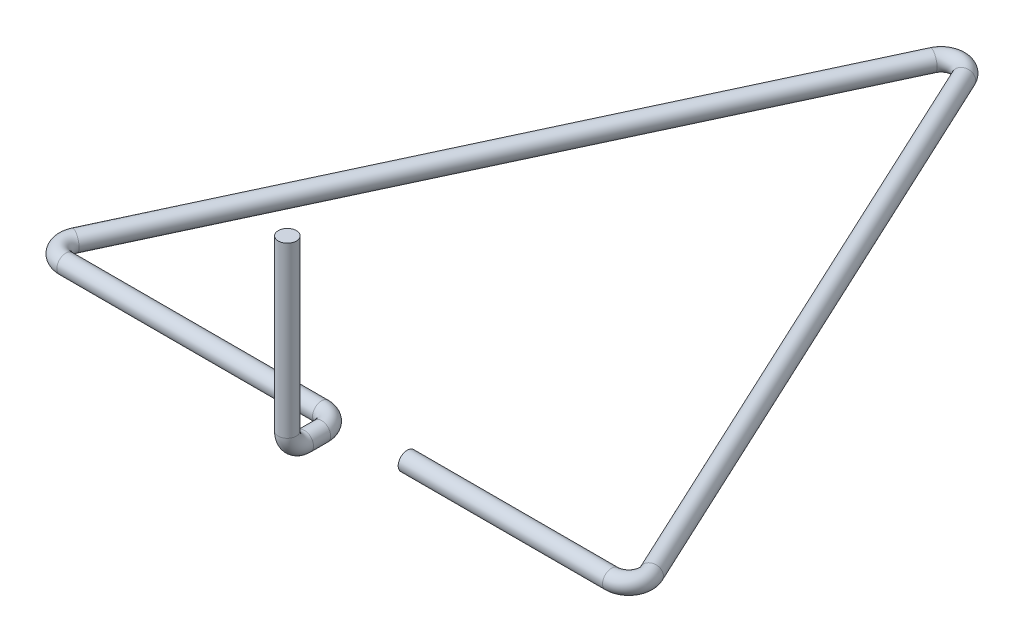
ISO-10303-21;
HEADER;
FILE_DESCRIPTION(('STEP AP214'),'2;1');
FILE_NAME('part.step','',(''),(''),'','','');
FILE_SCHEMA(('AUTOMOTIVE_DESIGN { 1 0 10303 214 1 1 1 1 }'));
ENDSEC;
DATA;
#1=APPLICATION_CONTEXT('core data for automotive mechanical design processes');
#2=APPLICATION_PROTOCOL_DEFINITION('international standard','automotive_design',2000,#1);
#3=PRODUCT_CONTEXT('',#1,'mechanical');
#4=PRODUCT('Part','Part','',(#3));
#5=PRODUCT_RELATED_PRODUCT_CATEGORY('part','',(#4));
#6=PRODUCT_DEFINITION_FORMATION('','',#4);
#7=PRODUCT_DEFINITION_CONTEXT('part definition',#1,'design');
#8=PRODUCT_DEFINITION('design','',#6,#7);
#9=PRODUCT_DEFINITION_SHAPE('','',#8);
#10=(LENGTH_UNIT() NAMED_UNIT(*) SI_UNIT(.MILLI.,.METRE.));
#11=(NAMED_UNIT(*) PLANE_ANGLE_UNIT() SI_UNIT($,.RADIAN.));
#12=(NAMED_UNIT(*) SI_UNIT($,.STERADIAN.) SOLID_ANGLE_UNIT());
#13=UNCERTAINTY_MEASURE_WITH_UNIT(LENGTH_MEASURE(1.E-05),#10,'distance_accuracy_value','');
#14=(GEOMETRIC_REPRESENTATION_CONTEXT(3) GLOBAL_UNCERTAINTY_ASSIGNED_CONTEXT((#13)) GLOBAL_UNIT_ASSIGNED_CONTEXT((#10,
#11,#12)) REPRESENTATION_CONTEXT('',''));
#15=CARTESIAN_POINT('',(0.,0.,0.));
#16=DIRECTION('',(0.,0.,1.));
#17=DIRECTION('',(1.,0.,0.));
#18=AXIS2_PLACEMENT_3D('',#15,#16,#17);
#19=CARTESIAN_POINT('',(12.,0.,-4.5));
#20=DIRECTION('',(1.,0.,0.));
#21=DIRECTION('',(0.,0.,-1.));
#22=AXIS2_PLACEMENT_3D('',#19,#20,#21);
#23=PLANE('',#22);
#24=CARTESIAN_POINT('',(12.,0.,-4.5));
#25=DIRECTION('',(1.,0.,0.));
#26=DIRECTION('',(0.,0.,-1.));
#27=AXIS2_PLACEMENT_3D('',#24,#25,#26);
#28=CIRCLE('',#27,1.585);
#29=CARTESIAN_POINT('',(12.,0.,-6.085));
#30=VERTEX_POINT('',#29);
#31=EDGE_CURVE('E50',#30,#30,#28,.T.);
#32=ORIENTED_EDGE('',*,*,#31,.F.);
#33=EDGE_LOOP('',(#32));
#34=FACE_BOUND('',#33,.T.);
#35=ADVANCED_FACE('F38',(#34),#23,.F.);
#36=CARTESIAN_POINT('',(12.,0.,-4.5));
#37=DIRECTION('',(1.,0.,0.));
#38=DIRECTION('',(0.,0.,-1.));
#39=AXIS2_PLACEMENT_3D('',#36,#37,#38);
#40=CYLINDRICAL_SURFACE('',#39,1.585);
#41=CARTESIAN_POINT('',(47.7909432686476,0.,-4.5));
#42=DIRECTION('',(1.,0.,0.));
#43=DIRECTION('',(0.,0.,-1.));
#44=AXIS2_PLACEMENT_3D('',#41,#42,#43);
#45=CIRCLE('',#44,1.585);
#46=CARTESIAN_POINT('',(47.7909432686476,0.,-2.915));
#47=VERTEX_POINT('',#46);
#48=EDGE_CURVE('E59',#47,#47,#45,.T.);
#49=ORIENTED_EDGE('',*,*,#48,.F.);
#50=EDGE_LOOP('',(#49));
#51=FACE_BOUND('',#50,.T.);
#52=ORIENTED_EDGE('',*,*,#31,.T.);
#53=EDGE_LOOP('',(#52));
#54=FACE_BOUND('',#53,.T.);
#55=ADVANCED_FACE('F120',(#51,#54),#40,.T.);
#56=CARTESIAN_POINT('',(47.7909432686476,0.,-7.5));
#57=DIRECTION('',(0.,1.,0.));
#58=DIRECTION('',(0.,0.,1.));
#59=AXIS2_PLACEMENT_3D('',#56,#57,#58);
#60=TOROIDAL_SURFACE('',#59,3.,1.585);
#61=CARTESIAN_POINT('',(50.5098666297575,0.,-8.76785478522209));
#62=DIRECTION('',(-0.422618261740697,0.,-0.906307787036651));
#63=DIRECTION('',(-0.906307787036651,0.,0.422618261740697));
#64=AXIS2_PLACEMENT_3D('',#61,#62,#63);
#65=CIRCLE('',#64,1.585);
#66=CARTESIAN_POINT('',(51.9463644722106,0.,-9.43770473008109));
#67=VERTEX_POINT('',#66);
#68=EDGE_CURVE('E68',#67,#67,#65,.T.);
#69=CARTESIAN_POINT('',(47.7909432686476,0.,-7.5));
#70=DIRECTION('',(0.,1.,0.));
#71=DIRECTION('',(0.,0.,1.));
#72=AXIS2_PLACEMENT_3D('',#69,#70,#71);
#73=CIRCLE('',#72,4.585);
#74=EDGE_CURVE('',#47,#67,#73,.T.);
#75=ORIENTED_EDGE('',*,*,#48,.T.);
#76=ORIENTED_EDGE('',*,*,#68,.F.);
#77=ORIENTED_EDGE('',*,*,#74,.T.);
#78=ORIENTED_EDGE('',*,*,#74,.F.);
#79=EDGE_LOOP('',(#75,#77,#76,#78));
#80=FACE_BOUND('',#79,.T.);
#81=ADVANCED_FACE('F114',(#80),#60,.T.);
#82=CARTESIAN_POINT('',(50.5098666297575,0.,-8.76785478522206));
#83=DIRECTION('',(-0.422618261740697,0.,-0.906307787036651));
#84=DIRECTION('',(-0.906307787036651,0.,0.422618261740697));
#85=AXIS2_PLACEMENT_3D('',#82,#83,#84);
#86=CYLINDRICAL_SURFACE('',#85,1.585);
#87=CARTESIAN_POINT('',(2.71892336110996,0.,-111.255863362517));
#88=DIRECTION('',(-0.422618261740697,0.,-0.906307787036651));
#89=DIRECTION('',(-0.906307787036651,0.,0.422618261740697));
#90=AXIS2_PLACEMENT_3D('',#87,#88,#89);
#91=CIRCLE('',#90,1.585);
#92=CARTESIAN_POINT('',(4.15542120356305,0.,-111.925713307376));
#93=VERTEX_POINT('',#92);
#94=EDGE_CURVE('E71',#93,#93,#91,.T.);
#95=ORIENTED_EDGE('',*,*,#94,.F.);
#96=EDGE_LOOP('',(#95));
#97=FACE_BOUND('',#96,.T.);
#98=ORIENTED_EDGE('',*,*,#68,.T.);
#99=EDGE_LOOP('',(#98));
#100=FACE_BOUND('',#99,.T.);
#101=ADVANCED_FACE('F108',(#97,#100),#86,.T.);
#102=CARTESIAN_POINT('',(0.,0.,-109.988008577295));
#103=DIRECTION('',(0.,1.,0.));
#104=DIRECTION('',(0.,0.,1.));
#105=AXIS2_PLACEMENT_3D('',#102,#103,#104);
#106=TOROIDAL_SURFACE('',#105,3.,1.585);
#107=CARTESIAN_POINT('',(-2.71892336110995,0.,-111.255863362517));
#108=DIRECTION('',(-0.422618261740698,0.,0.906307787036651));
#109=DIRECTION('',(0.906307787036651,0.,0.422618261740698));
#110=AXIS2_PLACEMENT_3D('',#107,#108,#109);
#111=CIRCLE('',#110,1.585);
#112=CARTESIAN_POINT('',(-4.15542120356304,0.,-111.925713307376));
#113=VERTEX_POINT('',#112);
#114=EDGE_CURVE('E74',#113,#113,#111,.T.);
#115=CARTESIAN_POINT('',(0.,0.,-109.988008577295));
#116=DIRECTION('',(0.,1.,0.));
#117=DIRECTION('',(0.,0.,1.));
#118=AXIS2_PLACEMENT_3D('',#115,#116,#117);
#119=CIRCLE('',#118,4.585);
#120=EDGE_CURVE('',#93,#113,#119,.T.);
#121=ORIENTED_EDGE('',*,*,#94,.T.);
#122=ORIENTED_EDGE('',*,*,#114,.F.);
#123=ORIENTED_EDGE('',*,*,#120,.T.);
#124=ORIENTED_EDGE('',*,*,#120,.F.);
#125=EDGE_LOOP('',(#121,#123,#122,#124));
#126=FACE_BOUND('',#125,.T.);
#127=ADVANCED_FACE('F102',(#126),#106,.T.);
#128=CARTESIAN_POINT('',(-2.71892336110995,0.,-111.255863362517));
#129=DIRECTION('',(-0.422618261740697,0.,0.906307787036651));
#130=DIRECTION('',(0.906307787036651,0.,0.422618261740697));
#131=AXIS2_PLACEMENT_3D('',#128,#129,#130);
#132=CYLINDRICAL_SURFACE('',#131,1.585);
#133=CARTESIAN_POINT('',(-50.5098666297575,0.,-8.76785478522209));
#134=DIRECTION('',(-0.422618261740697,0.,0.906307787036651));
#135=DIRECTION('',(0.906307787036651,0.,0.422618261740697));
#136=AXIS2_PLACEMENT_3D('',#133,#134,#135);
#137=CIRCLE('',#136,1.585);
#138=CARTESIAN_POINT('',(-51.9463644722106,0.,-9.4377047300811));
#139=VERTEX_POINT('',#138);
#140=EDGE_CURVE('E77',#139,#139,#137,.T.);
#141=ORIENTED_EDGE('',*,*,#140,.F.);
#142=EDGE_LOOP('',(#141));
#143=FACE_BOUND('',#142,.T.);
#144=ORIENTED_EDGE('',*,*,#114,.T.);
#145=EDGE_LOOP('',(#144));
#146=FACE_BOUND('',#145,.T.);
#147=ADVANCED_FACE('F96',(#143,#146),#132,.T.);
#148=CARTESIAN_POINT('',(-47.7909432686475,0.,-7.5));
#149=DIRECTION('',(0.,1.,0.));
#150=DIRECTION('',(0.,0.,1.));
#151=AXIS2_PLACEMENT_3D('',#148,#149,#150);
#152=TOROIDAL_SURFACE('',#151,3.,1.585);
#153=CARTESIAN_POINT('',(-47.7909432686475,0.,-4.5));
#154=DIRECTION('',(1.,0.,0.));
#155=DIRECTION('',(0.,0.,-1.));
#156=AXIS2_PLACEMENT_3D('',#153,#154,#155);
#157=CIRCLE('',#156,1.585);
#158=CARTESIAN_POINT('',(-47.7909432686475,0.,-2.915));
#159=VERTEX_POINT('',#158);
#160=EDGE_CURVE('E80',#159,#159,#157,.T.);
#161=CARTESIAN_POINT('',(-47.7909432686475,0.,-7.5));
#162=DIRECTION('',(0.,1.,0.));
#163=DIRECTION('',(0.,0.,1.));
#164=AXIS2_PLACEMENT_3D('',#161,#162,#163);
#165=CIRCLE('',#164,4.585);
#166=EDGE_CURVE('',#139,#159,#165,.T.);
#167=ORIENTED_EDGE('',*,*,#140,.T.);
#168=ORIENTED_EDGE('',*,*,#160,.F.);
#169=ORIENTED_EDGE('',*,*,#166,.T.);
#170=ORIENTED_EDGE('',*,*,#166,.F.);
#171=EDGE_LOOP('',(#167,#169,#168,#170));
#172=FACE_BOUND('',#171,.T.);
#173=ADVANCED_FACE('F90',(#172),#152,.T.);
#174=CARTESIAN_POINT('',(-47.7909432686475,0.,-4.5));
#175=DIRECTION('',(1.,0.,0.));
#176=DIRECTION('',(0.,0.,-1.));
#177=AXIS2_PLACEMENT_3D('',#174,#175,#176);
#178=CYLINDRICAL_SURFACE('',#177,1.585);
#179=CARTESIAN_POINT('',(-3.,0.,-4.5));
#180=DIRECTION('',(1.,0.,0.));
#181=DIRECTION('',(0.,0.,-1.));
#182=AXIS2_PLACEMENT_3D('',#179,#180,#181);
#183=CIRCLE('',#182,1.585);
#184=CARTESIAN_POINT('',(-3.,0.,-6.085));
#185=VERTEX_POINT('',#184);
#186=EDGE_CURVE('E45',#185,#185,#183,.T.);
#187=ORIENTED_EDGE('',*,*,#186,.F.);
#188=EDGE_LOOP('',(#187));
#189=FACE_BOUND('',#188,.T.);
#190=ORIENTED_EDGE('',*,*,#160,.T.);
#191=EDGE_LOOP('',(#190));
#192=FACE_BOUND('',#191,.T.);
#193=ADVANCED_FACE('F87',(#189,#192),#178,.T.);
#194=CARTESIAN_POINT('',(-3.,0.,-1.5));
#195=DIRECTION('',(0.,-1.,0.));
#196=DIRECTION('',(0.,0.,-1.));
#197=AXIS2_PLACEMENT_3D('',#194,#195,#196);
#198=TOROIDAL_SURFACE('',#197,3.,1.585);
#199=CARTESIAN_POINT('',(0.,0.,-1.5));
#200=DIRECTION('',(0.,0.,1.));
#201=DIRECTION('',(1.,0.,0.));
#202=AXIS2_PLACEMENT_3D('',#199,#200,#201);
#203=CIRCLE('',#202,1.585);
#204=CARTESIAN_POINT('',(1.585,0.,-1.5));
#205=VERTEX_POINT('',#204);
#206=EDGE_CURVE('E12',#205,#205,#203,.T.);
#207=CARTESIAN_POINT('',(-3.,0.,-1.5));
#208=DIRECTION('',(0.,-1.,0.));
#209=DIRECTION('',(0.,0.,-1.));
#210=AXIS2_PLACEMENT_3D('',#207,#208,#209);
#211=CIRCLE('',#210,4.585);
#212=EDGE_CURVE('',#185,#205,#211,.T.);
#213=ORIENTED_EDGE('',*,*,#186,.T.);
#214=ORIENTED_EDGE('',*,*,#206,.F.);
#215=ORIENTED_EDGE('',*,*,#212,.T.);
#216=ORIENTED_EDGE('',*,*,#212,.F.);
#217=EDGE_LOOP('',(#213,#215,#214,#216));
#218=FACE_BOUND('',#217,.T.);
#219=ADVANCED_FACE('F85',(#218),#198,.T.);
#220=CARTESIAN_POINT('',(0.,0.,-1.5));
#221=DIRECTION('',(0.,0.,1.));
#222=DIRECTION('',(1.,0.,0.));
#223=AXIS2_PLACEMENT_3D('',#220,#221,#222);
#224=CYLINDRICAL_SURFACE('',#223,1.585);
#225=ORIENTED_EDGE('',*,*,#206,.T.);
#226=EDGE_LOOP('',(#225));
#227=FACE_BOUND('',#226,.T.);
#228=CARTESIAN_POINT('',(0.,0.,1.49999999999998));
#229=DIRECTION('',(0.,0.,1.));
#230=DIRECTION('',(1.,0.,0.));
#231=AXIS2_PLACEMENT_3D('',#228,#229,#230);
#232=CIRCLE('',#231,1.585);
#233=CARTESIAN_POINT('',(0.,-1.585,1.49999999999997));
#234=VERTEX_POINT('',#233);
#235=EDGE_CURVE('E62',#234,#234,#232,.T.);
#236=ORIENTED_EDGE('',*,*,#235,.F.);
#237=EDGE_LOOP('',(#236));
#238=FACE_BOUND('',#237,.T.);
#239=ADVANCED_FACE('F132',(#227,#238),#224,.T.);
#240=CARTESIAN_POINT('',(0.,32.6,4.5));
#241=DIRECTION('',(0.,1.,0.));
#242=DIRECTION('',(1.,0.,0.));
#243=AXIS2_PLACEMENT_3D('',#240,#241,#242);
#244=PLANE('',#243);
#245=CARTESIAN_POINT('',(0.,32.6,4.5));
#246=DIRECTION('',(0.,1.,0.));
#247=DIRECTION('',(1.,0.,0.));
#248=AXIS2_PLACEMENT_3D('',#245,#246,#247);
#249=CIRCLE('',#248,1.585);
#250=CARTESIAN_POINT('',(1.585,32.6,4.5));
#251=VERTEX_POINT('',#250);
#252=EDGE_CURVE('E54',#251,#251,#249,.T.);
#253=ORIENTED_EDGE('',*,*,#252,.T.);
#254=EDGE_LOOP('',(#253));
#255=FACE_BOUND('',#254,.T.);
#256=ADVANCED_FACE('F55',(#255),#244,.T.);
#257=CARTESIAN_POINT('',(0.,3.,1.5));
#258=DIRECTION('',(-1.,0.,0.));
#259=DIRECTION('',(0.,0.,1.));
#260=AXIS2_PLACEMENT_3D('',#257,#258,#259);
#261=TOROIDAL_SURFACE('',#260,3.,1.585);
#262=CARTESIAN_POINT('',(0.,3.,4.5));
#263=DIRECTION('',(0.,1.,0.));
#264=DIRECTION('',(1.,0.,0.));
#265=AXIS2_PLACEMENT_3D('',#262,#263,#264);
#266=CIRCLE('',#265,1.585);
#267=CARTESIAN_POINT('',(0.,3.,6.085));
#268=VERTEX_POINT('',#267);
#269=EDGE_CURVE('E57',#268,#268,#266,.T.);
#270=CARTESIAN_POINT('',(0.,3.,1.5));
#271=DIRECTION('',(-1.,0.,0.));
#272=DIRECTION('',(0.,0.,1.));
#273=AXIS2_PLACEMENT_3D('',#270,#271,#272);
#274=CIRCLE('',#273,4.585);
#275=EDGE_CURVE('',#234,#268,#274,.T.);
#276=ORIENTED_EDGE('',*,*,#235,.T.);
#277=ORIENTED_EDGE('',*,*,#269,.F.);
#278=ORIENTED_EDGE('',*,*,#275,.T.);
#279=ORIENTED_EDGE('',*,*,#275,.F.);
#280=EDGE_LOOP('',(#276,#278,#277,#279));
#281=FACE_BOUND('',#280,.T.);
#282=ADVANCED_FACE('F139',(#281),#261,.T.);
#283=CARTESIAN_POINT('',(0.,3.,4.5));
#284=DIRECTION('',(0.,1.,0.));
#285=DIRECTION('',(0.,0.,1.));
#286=AXIS2_PLACEMENT_3D('',#283,#284,#285);
#287=CYLINDRICAL_SURFACE('',#286,1.585);
#288=ORIENTED_EDGE('',*,*,#252,.F.);
#289=EDGE_LOOP('',(#288));
#290=FACE_BOUND('',#289,.T.);
#291=ORIENTED_EDGE('',*,*,#269,.T.);
#292=EDGE_LOOP('',(#291));
#293=FACE_BOUND('',#292,.T.);
#294=ADVANCED_FACE('F130',(#290,#293),#287,.T.);
#295=CLOSED_SHELL('',(#35,#55,#81,#101,#127,#147,#173,#193,#219,#239,#256,#282,#294));
#296=MANIFOLD_SOLID_BREP('B2',#295);
#297=ADVANCED_BREP_SHAPE_REPRESENTATION('',(#18,#296),#14);
#298=SHAPE_DEFINITION_REPRESENTATION(#9,#297);
ENDSEC;
END-ISO-10303-21;
